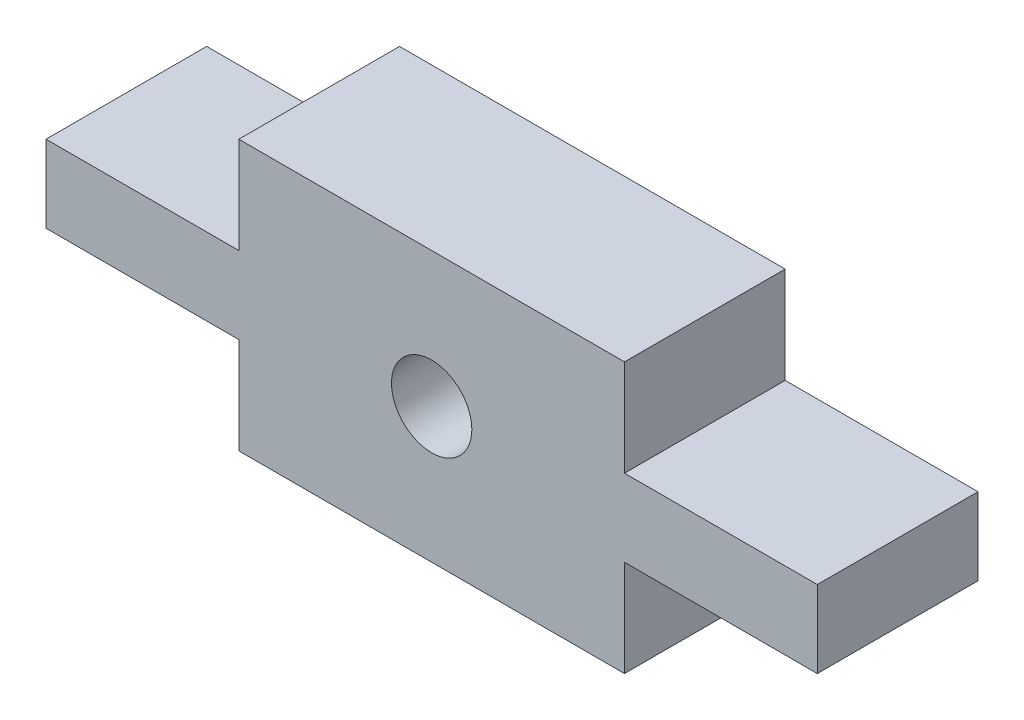
ISO-10303-21;
HEADER;
FILE_DESCRIPTION(('STEP AP214'),'2;1');
FILE_NAME('part.step','',(''),(''),'','','');
FILE_SCHEMA(('AUTOMOTIVE_DESIGN { 1 0 10303 214 1 1 1 1 }'));
ENDSEC;
DATA;
#1=APPLICATION_CONTEXT('core data for automotive mechanical design processes');
#2=APPLICATION_PROTOCOL_DEFINITION('international standard','automotive_design',2000,#1);
#3=PRODUCT_CONTEXT('',#1,'mechanical');
#4=PRODUCT('Part','Part','',(#3));
#5=PRODUCT_RELATED_PRODUCT_CATEGORY('part','',(#4));
#6=PRODUCT_DEFINITION_FORMATION('','',#4);
#7=PRODUCT_DEFINITION_CONTEXT('part definition',#1,'design');
#8=PRODUCT_DEFINITION('design','',#6,#7);
#9=PRODUCT_DEFINITION_SHAPE('','',#8);
#10=(LENGTH_UNIT() NAMED_UNIT(*) SI_UNIT(.MILLI.,.METRE.));
#11=(NAMED_UNIT(*) PLANE_ANGLE_UNIT() SI_UNIT($,.RADIAN.));
#12=(NAMED_UNIT(*) SI_UNIT($,.STERADIAN.) SOLID_ANGLE_UNIT());
#13=UNCERTAINTY_MEASURE_WITH_UNIT(LENGTH_MEASURE(1.E-05),#10,'distance_accuracy_value','');
#14=(GEOMETRIC_REPRESENTATION_CONTEXT(3) GLOBAL_UNCERTAINTY_ASSIGNED_CONTEXT((#13)) GLOBAL_UNIT_ASSIGNED_CONTEXT((#10,
#11,#12)) REPRESENTATION_CONTEXT('',''));
#15=CARTESIAN_POINT('',(0.,0.,0.));
#16=DIRECTION('',(0.,0.,1.));
#17=DIRECTION('',(1.,0.,0.));
#18=AXIS2_PLACEMENT_3D('',#15,#16,#17);
#19=CARTESIAN_POINT('',(0.,0.,5.));
#20=DIRECTION('',(0.,0.,-1.));
#21=DIRECTION('',(-1.,0.,0.));
#22=AXIS2_PLACEMENT_3D('',#19,#20,#21);
#23=PLANE('',#22);
#24=DIRECTION('',(-0.999999999930555,1.17851889356534E-05,0.));
#25=VECTOR('',#24,1.);
#26=CARTESIAN_POINT('',(2365.2396252979,1637.48427422447,5.));
#27=LINE('',#26,#25);
#28=CARTESIAN_POINT('',(2377.23951021652,1637.48413280356,5.));
#29=VERTEX_POINT('',#28);
#30=CARTESIAN_POINT('',(2365.2396252979,1637.48427422447,5.));
#31=VERTEX_POINT('',#30);
#32=EDGE_CURVE('E200',#29,#31,#27,.T.);
#33=ORIENTED_EDGE('',*,*,#32,.T.);
#34=DIRECTION('',(-5.89238710354284E-05,-0.999999998263989,0.));
#35=VECTOR('',#34,1.);
#36=CARTESIAN_POINT('',(2365.23944851965,1634.48416157513,5.));
#37=LINE('',#36,#35);
#38=CARTESIAN_POINT('',(2365.23944851965,1634.48416157513,5.));
#39=VERTEX_POINT('',#38);
#40=EDGE_CURVE('E112',#31,#39,#37,.T.);
#41=ORIENTED_EDGE('',*,*,#40,.T.);
#42=DIRECTION('',(-0.999999999722221,2.35702760606771E-05,0.));
#43=VECTOR('',#42,1.);
#44=CARTESIAN_POINT('',(2359.2394353505,1634.4843029971,5.));
#45=LINE('',#44,#43);
#46=CARTESIAN_POINT('',(2359.2394353505,1634.4843029971,5.));
#47=VERTEX_POINT('',#46);
#48=EDGE_CURVE('E237',#39,#47,#45,.T.);
#49=ORIENTED_EDGE('',*,*,#48,.T.);
#50=DIRECTION('',(-1.17851889330036E-05,-0.999999999930555,0.));
#51=VECTOR('',#50,1.);
#52=CARTESIAN_POINT('',(2359.2394353505,1634.4843029971,5.));
#53=LINE('',#52,#51);
#54=CARTESIAN_POINT('',(2359.23940706532,1632.08424116056,5.));
#55=VERTEX_POINT('',#54);
#56=EDGE_CURVE('E257',#47,#55,#53,.T.);
#57=ORIENTED_EDGE('',*,*,#56,.T.);
#58=DIRECTION('',(1.,-7.53469705410102E-11,0.));
#59=VECTOR('',#58,1.);
#60=CARTESIAN_POINT('',(2365.23942023614,1632.08424116011,5.));
#61=LINE('',#60,#59);
#62=CARTESIAN_POINT('',(2365.23942023614,1632.08424116011,5.));
#63=VERTEX_POINT('',#62);
#64=EDGE_CURVE('E253',#55,#63,#61,.T.);
#65=ORIENTED_EDGE('',*,*,#64,.T.);
#66=DIRECTION('',(1.17847075810225E-05,-0.99999999993056,0.));
#67=VECTOR('',#66,1.);
#68=CARTESIAN_POINT('',(2365.23945559075,1629.08419921878,5.));
#69=LINE('',#68,#67);
#70=CARTESIAN_POINT('',(2365.23945559075,1629.08419921878,5.));
#71=VERTEX_POINT('',#70);
#72=EDGE_CURVE('E256',#63,#71,#69,.T.);
#73=ORIENTED_EDGE('',*,*,#72,.T.);
#74=DIRECTION('',(0.999999999982639,-5.89257828594326E-06,0.));
#75=VECTOR('',#74,1.);
#76=CARTESIAN_POINT('',(2365.23945559075,1629.08419921878,5.));
#77=LINE('',#76,#75);
#78=CARTESIAN_POINT('',(2377.23941122088,1629.08412850811,5.));
#79=VERTEX_POINT('',#78);
#80=EDGE_CURVE('E261',#71,#79,#77,.T.);
#81=ORIENTED_EDGE('',*,*,#80,.T.);
#82=DIRECTION('',(3.53550858177555E-05,0.999999999375009,0.));
#83=VECTOR('',#82,1.);
#84=CARTESIAN_POINT('',(2377.23951728762,1632.0841704472,5.));
#85=LINE('',#84,#83);
#86=CARTESIAN_POINT('',(2377.23951728762,1632.0841704472,5.));
#87=VERTEX_POINT('',#86);
#88=EDGE_CURVE('E268',#79,#87,#85,.T.);
#89=ORIENTED_EDGE('',*,*,#88,.T.);
#90=DIRECTION('',(0.99999999937499,-3.53556374080018E-05,0.));
#91=VECTOR('',#90,1.);
#92=CARTESIAN_POINT('',(2383.23945974526,1632.0839583154,5.));
#93=LINE('',#92,#91);
#94=CARTESIAN_POINT('',(2383.23945974526,1632.0839583154,5.));
#95=VERTEX_POINT('',#94);
#96=EDGE_CURVE('E143',#87,#95,#93,.T.);
#97=ORIENTED_EDGE('',*,*,#96,.T.);
#98=DIRECTION('',(1.17851885629366E-05,0.999999999930555,0.));
#99=VECTOR('',#98,1.);
#100=CARTESIAN_POINT('',(2383.23945974526,1632.0839583154,5.));
#101=LINE('',#100,#99);
#102=CARTESIAN_POINT('',(2383.23948803044,1634.48402015194,5.));
#103=VERTEX_POINT('',#102);
#104=EDGE_CURVE('E137',#95,#103,#101,.T.);
#105=ORIENTED_EDGE('',*,*,#104,.T.);
#106=DIRECTION('',(-1.,1.01622191112792E-10,0.));
#107=VECTOR('',#106,1.);
#108=CARTESIAN_POINT('',(2377.23947485962,1634.48402015255,5.));
#109=LINE('',#108,#107);
#110=CARTESIAN_POINT('',(2377.23947485962,1634.48402015255,5.));
#111=VERTEX_POINT('',#110);
#112=EDGE_CURVE('E141',#103,#111,#109,.T.);
#113=ORIENTED_EDGE('',*,*,#112,.T.);
#114=DIRECTION('',(1.17851887470895E-05,0.999999999930555,0.));
#115=VECTOR('',#114,1.);
#116=CARTESIAN_POINT('',(2377.23951021652,1637.48413280356,5.));
#117=LINE('',#116,#115);
#118=EDGE_CURVE('E57',#111,#29,#117,.T.);
#119=ORIENTED_EDGE('',*,*,#118,.T.);
#120=EDGE_LOOP('',(#33,#41,#49,#57,#65,#73,#81,#89,#97,#105,#113,#119));
#121=FACE_BOUND('',#120,.T.);
#122=CARTESIAN_POINT('',(2371.23951825939,1633.2842013661,5.));
#123=DIRECTION('',(0.,0.,1.));
#124=DIRECTION('',(1.,0.,0.));
#125=AXIS2_PLACEMENT_3D('',#122,#123,#124);
#126=CIRCLE('',#125,1.25000000000008);
#127=CARTESIAN_POINT('',(2372.48951825939,1633.2842013661,5.));
#128=VERTEX_POINT('',#127);
#129=EDGE_CURVE('E170',#128,#128,#126,.T.);
#130=ORIENTED_EDGE('',*,*,#129,.F.);
#131=EDGE_LOOP('',(#130));
#132=FACE_BOUND('',#131,.T.);
#133=ADVANCED_FACE('F39',(#121,#132),#23,.F.);
#134=CARTESIAN_POINT('',(0.,0.,0.));
#135=DIRECTION('',(0.,0.,-1.));
#136=DIRECTION('',(-1.,0.,0.));
#137=AXIS2_PLACEMENT_3D('',#134,#135,#136);
#138=PLANE('',#137);
#139=DIRECTION('',(-0.999999999930555,1.17851889356534E-05,0.));
#140=VECTOR('',#139,1.);
#141=CARTESIAN_POINT('',(2365.2396252979,1637.48427422447,0.));
#142=LINE('',#141,#140);
#143=CARTESIAN_POINT('',(2377.23951021652,1637.48413280356,0.));
#144=VERTEX_POINT('',#143);
#145=CARTESIAN_POINT('',(2365.2396252979,1637.48427422447,0.));
#146=VERTEX_POINT('',#145);
#147=EDGE_CURVE('E165',#144,#146,#142,.T.);
#148=ORIENTED_EDGE('',*,*,#147,.F.);
#149=DIRECTION('',(1.17851887470895E-05,0.999999999930555,0.));
#150=VECTOR('',#149,1.);
#151=CARTESIAN_POINT('',(2377.23951021652,1637.48413280356,0.));
#152=LINE('',#151,#150);
#153=CARTESIAN_POINT('',(2377.23947485962,1634.48402015255,0.));
#154=VERTEX_POINT('',#153);
#155=EDGE_CURVE('E104',#154,#144,#152,.T.);
#156=ORIENTED_EDGE('',*,*,#155,.F.);
#157=DIRECTION('',(-1.,1.01622191112792E-10,0.));
#158=VECTOR('',#157,1.);
#159=CARTESIAN_POINT('',(2377.23947485962,1634.48402015255,0.));
#160=LINE('',#159,#158);
#161=CARTESIAN_POINT('',(2383.23948803044,1634.48402015194,0.));
#162=VERTEX_POINT('',#161);
#163=EDGE_CURVE('E98',#162,#154,#160,.T.);
#164=ORIENTED_EDGE('',*,*,#163,.F.);
#165=DIRECTION('',(1.17851885629366E-05,0.999999999930555,0.));
#166=VECTOR('',#165,1.);
#167=CARTESIAN_POINT('',(2383.23945974526,1632.0839583154,0.));
#168=LINE('',#167,#166);
#169=CARTESIAN_POINT('',(2383.23945974526,1632.0839583154,0.));
#170=VERTEX_POINT('',#169);
#171=EDGE_CURVE('E152',#170,#162,#168,.T.);
#172=ORIENTED_EDGE('',*,*,#171,.F.);
#173=DIRECTION('',(0.99999999937499,-3.53556374080018E-05,0.));
#174=VECTOR('',#173,1.);
#175=CARTESIAN_POINT('',(2383.23945974526,1632.0839583154,0.));
#176=LINE('',#175,#174);
#177=CARTESIAN_POINT('',(2377.23951728762,1632.0841704472,0.));
#178=VERTEX_POINT('',#177);
#179=EDGE_CURVE('E191',#178,#170,#176,.T.);
#180=ORIENTED_EDGE('',*,*,#179,.F.);
#181=DIRECTION('',(3.53550858177555E-05,0.999999999375009,0.));
#182=VECTOR('',#181,1.);
#183=CARTESIAN_POINT('',(2377.23951728762,1632.0841704472,0.));
#184=LINE('',#183,#182);
#185=CARTESIAN_POINT('',(2377.23941122088,1629.08412850811,0.));
#186=VERTEX_POINT('',#185);
#187=EDGE_CURVE('E188',#186,#178,#184,.T.);
#188=ORIENTED_EDGE('',*,*,#187,.F.);
#189=DIRECTION('',(0.999999999982639,-5.89257828594326E-06,0.));
#190=VECTOR('',#189,1.);
#191=CARTESIAN_POINT('',(2365.23945559075,1629.08419921878,0.));
#192=LINE('',#191,#190);
#193=CARTESIAN_POINT('',(2365.23945559075,1629.08419921878,0.));
#194=VERTEX_POINT('',#193);
#195=EDGE_CURVE('E185',#194,#186,#192,.T.);
#196=ORIENTED_EDGE('',*,*,#195,.F.);
#197=DIRECTION('',(1.17847075810225E-05,-0.99999999993056,0.));
#198=VECTOR('',#197,1.);
#199=CARTESIAN_POINT('',(2365.23945559075,1629.08419921878,0.));
#200=LINE('',#199,#198);
#201=CARTESIAN_POINT('',(2365.23942023614,1632.08424116011,0.));
#202=VERTEX_POINT('',#201);
#203=EDGE_CURVE('E182',#202,#194,#200,.T.);
#204=ORIENTED_EDGE('',*,*,#203,.F.);
#205=DIRECTION('',(1.,-7.53469705410102E-11,0.));
#206=VECTOR('',#205,1.);
#207=CARTESIAN_POINT('',(2365.23942023614,1632.08424116011,0.));
#208=LINE('',#207,#206);
#209=CARTESIAN_POINT('',(2359.23940706532,1632.08424116056,0.));
#210=VERTEX_POINT('',#209);
#211=EDGE_CURVE('E179',#210,#202,#208,.T.);
#212=ORIENTED_EDGE('',*,*,#211,.F.);
#213=DIRECTION('',(-1.17851889330036E-05,-0.999999999930555,0.));
#214=VECTOR('',#213,1.);
#215=CARTESIAN_POINT('',(2359.2394353505,1634.4843029971,0.));
#216=LINE('',#215,#214);
#217=CARTESIAN_POINT('',(2359.2394353505,1634.4843029971,0.));
#218=VERTEX_POINT('',#217);
#219=EDGE_CURVE('E176',#218,#210,#216,.T.);
#220=ORIENTED_EDGE('',*,*,#219,.F.);
#221=DIRECTION('',(-0.999999999722221,2.35702760606771E-05,0.));
#222=VECTOR('',#221,1.);
#223=CARTESIAN_POINT('',(2359.2394353505,1634.4843029971,0.));
#224=LINE('',#223,#222);
#225=CARTESIAN_POINT('',(2365.23944851965,1634.48416157513,0.));
#226=VERTEX_POINT('',#225);
#227=EDGE_CURVE('E173',#226,#218,#224,.T.);
#228=ORIENTED_EDGE('',*,*,#227,.F.);
#229=DIRECTION('',(-5.89238710354284E-05,-0.999999998263989,0.));
#230=VECTOR('',#229,1.);
#231=CARTESIAN_POINT('',(2365.23944851965,1634.48416157513,0.));
#232=LINE('',#231,#230);
#233=EDGE_CURVE('E169',#146,#226,#232,.T.);
#234=ORIENTED_EDGE('',*,*,#233,.F.);
#235=EDGE_LOOP('',(#148,#156,#164,#172,#180,#188,#196,#204,#212,#220,#228,#234));
#236=FACE_BOUND('',#235,.T.);
#237=CARTESIAN_POINT('',(2371.23951825939,1633.2842013661,0.));
#238=DIRECTION('',(0.,0.,1.));
#239=DIRECTION('',(1.,0.,0.));
#240=AXIS2_PLACEMENT_3D('',#237,#238,#239);
#241=CIRCLE('',#240,1.25000000000008);
#242=CARTESIAN_POINT('',(2372.48951825939,1633.2842013661,0.));
#243=VERTEX_POINT('',#242);
#244=EDGE_CURVE('E417',#243,#243,#241,.T.);
#245=ORIENTED_EDGE('',*,*,#244,.T.);
#246=EDGE_LOOP('',(#245));
#247=FACE_BOUND('',#246,.T.);
#248=ADVANCED_FACE('F241',(#236,#247),#138,.T.);
#249=CARTESIAN_POINT('',(2365.2396252979,1637.48427422447,5.));
#250=DIRECTION('',(-1.17851889356534E-05,-0.999999999930555,0.));
#251=DIRECTION('',(0.999999999930555,-1.17851889356534E-05,0.));
#252=AXIS2_PLACEMENT_3D('',#249,#250,#251);
#253=PLANE('',#252);
#254=ORIENTED_EDGE('',*,*,#147,.T.);
#255=DIRECTION('',(0.,0.,-1.));
#256=VECTOR('',#255,1.);
#257=CARTESIAN_POINT('',(2365.2396252979,1637.48427422447,5.));
#258=LINE('',#257,#256);
#259=EDGE_CURVE('E11',#31,#146,#258,.T.);
#260=ORIENTED_EDGE('',*,*,#259,.F.);
#261=ORIENTED_EDGE('',*,*,#32,.F.);
#262=DIRECTION('',(0.,0.,-1.));
#263=VECTOR('',#262,1.);
#264=CARTESIAN_POINT('',(2377.23951021652,1637.48413280356,5.));
#265=LINE('',#264,#263);
#266=EDGE_CURVE('E161',#29,#144,#265,.T.);
#267=ORIENTED_EDGE('',*,*,#266,.T.);
#268=EDGE_LOOP('',(#254,#260,#261,#267));
#269=FACE_BOUND('',#268,.T.);
#270=ADVANCED_FACE('F41',(#269),#253,.F.);
#271=CARTESIAN_POINT('',(2365.23944851965,1634.48416157513,5.));
#272=DIRECTION('',(0.999999998263989,-5.89238710354284E-05,0.));
#273=DIRECTION('',(5.89238710354284E-05,0.999999998263989,0.));
#274=AXIS2_PLACEMENT_3D('',#271,#272,#273);
#275=PLANE('',#274);
#276=ORIENTED_EDGE('',*,*,#233,.T.);
#277=DIRECTION('',(0.,0.,-1.));
#278=VECTOR('',#277,1.);
#279=CARTESIAN_POINT('',(2365.23944851965,1634.48416157513,5.));
#280=LINE('',#279,#278);
#281=EDGE_CURVE('E49',#39,#226,#280,.T.);
#282=ORIENTED_EDGE('',*,*,#281,.F.);
#283=ORIENTED_EDGE('',*,*,#40,.F.);
#284=ORIENTED_EDGE('',*,*,#259,.T.);
#285=EDGE_LOOP('',(#276,#282,#283,#284));
#286=FACE_BOUND('',#285,.T.);
#287=ADVANCED_FACE('F304',(#286),#275,.F.);
#288=CARTESIAN_POINT('',(2359.2394353505,1634.4843029971,5.));
#289=DIRECTION('',(-2.35702760606771E-05,-0.999999999722221,0.));
#290=DIRECTION('',(0.999999999722221,-2.35702760606771E-05,0.));
#291=AXIS2_PLACEMENT_3D('',#288,#289,#290);
#292=PLANE('',#291);
#293=ORIENTED_EDGE('',*,*,#227,.T.);
#294=DIRECTION('',(0.,0.,-1.));
#295=VECTOR('',#294,1.);
#296=CARTESIAN_POINT('',(2359.2394353505,1634.4843029971,5.));
#297=LINE('',#296,#295);
#298=EDGE_CURVE('E227',#47,#218,#297,.T.);
#299=ORIENTED_EDGE('',*,*,#298,.F.);
#300=ORIENTED_EDGE('',*,*,#48,.F.);
#301=ORIENTED_EDGE('',*,*,#281,.T.);
#302=EDGE_LOOP('',(#293,#299,#300,#301));
#303=FACE_BOUND('',#302,.T.);
#304=ADVANCED_FACE('F235',(#303),#292,.F.);
#305=CARTESIAN_POINT('',(2359.2394353505,1634.4843029971,5.));
#306=DIRECTION('',(0.999999999930555,-1.17851889330036E-05,0.));
#307=DIRECTION('',(1.17851889330036E-05,0.999999999930555,0.));
#308=AXIS2_PLACEMENT_3D('',#305,#306,#307);
#309=PLANE('',#308);
#310=ORIENTED_EDGE('',*,*,#219,.T.);
#311=DIRECTION('',(0.,0.,-1.));
#312=VECTOR('',#311,1.);
#313=CARTESIAN_POINT('',(2359.23940706532,1632.08424116056,5.));
#314=LINE('',#313,#312);
#315=EDGE_CURVE('E223',#55,#210,#314,.T.);
#316=ORIENTED_EDGE('',*,*,#315,.F.);
#317=ORIENTED_EDGE('',*,*,#56,.F.);
#318=ORIENTED_EDGE('',*,*,#298,.T.);
#319=EDGE_LOOP('',(#310,#316,#317,#318));
#320=FACE_BOUND('',#319,.T.);
#321=ADVANCED_FACE('F247',(#320),#309,.F.);
#322=CARTESIAN_POINT('',(2365.23942023614,1632.08424116011,5.));
#323=DIRECTION('',(7.53469705410102E-11,1.,0.));
#324=DIRECTION('',(-1.,7.53469705410102E-11,0.));
#325=AXIS2_PLACEMENT_3D('',#322,#323,#324);
#326=PLANE('',#325);
#327=ORIENTED_EDGE('',*,*,#211,.T.);
#328=DIRECTION('',(0.,0.,-1.));
#329=VECTOR('',#328,1.);
#330=CARTESIAN_POINT('',(2365.23942023614,1632.08424116011,5.));
#331=LINE('',#330,#329);
#332=EDGE_CURVE('E219',#63,#202,#331,.T.);
#333=ORIENTED_EDGE('',*,*,#332,.F.);
#334=ORIENTED_EDGE('',*,*,#64,.F.);
#335=ORIENTED_EDGE('',*,*,#315,.T.);
#336=EDGE_LOOP('',(#327,#333,#334,#335));
#337=FACE_BOUND('',#336,.T.);
#338=ADVANCED_FACE('F251',(#337),#326,.F.);
#339=CARTESIAN_POINT('',(2365.23945559075,1629.08419921878,5.));
#340=DIRECTION('',(0.99999999993056,1.17847075810225E-05,0.));
#341=DIRECTION('',(-1.17847075810225E-05,0.99999999993056,0.));
#342=AXIS2_PLACEMENT_3D('',#339,#340,#341);
#343=PLANE('',#342);
#344=ORIENTED_EDGE('',*,*,#203,.T.);
#345=DIRECTION('',(0.,0.,-1.));
#346=VECTOR('',#345,1.);
#347=CARTESIAN_POINT('',(2365.23945559075,1629.08419921878,5.));
#348=LINE('',#347,#346);
#349=EDGE_CURVE('E215',#71,#194,#348,.T.);
#350=ORIENTED_EDGE('',*,*,#349,.F.);
#351=ORIENTED_EDGE('',*,*,#72,.F.);
#352=ORIENTED_EDGE('',*,*,#332,.T.);
#353=EDGE_LOOP('',(#344,#350,#351,#352));
#354=FACE_BOUND('',#353,.T.);
#355=ADVANCED_FACE('F317',(#354),#343,.F.);
#356=CARTESIAN_POINT('',(2365.23945559075,1629.08419921878,5.));
#357=DIRECTION('',(5.89257828594326E-06,0.999999999982639,0.));
#358=DIRECTION('',(-0.999999999982639,5.89257828594326E-06,0.));
#359=AXIS2_PLACEMENT_3D('',#356,#357,#358);
#360=PLANE('',#359);
#361=ORIENTED_EDGE('',*,*,#195,.T.);
#362=DIRECTION('',(0.,0.,-1.));
#363=VECTOR('',#362,1.);
#364=CARTESIAN_POINT('',(2377.23941122088,1629.08412850811,5.));
#365=LINE('',#364,#363);
#366=EDGE_CURVE('E211',#79,#186,#365,.T.);
#367=ORIENTED_EDGE('',*,*,#366,.F.);
#368=ORIENTED_EDGE('',*,*,#80,.F.);
#369=ORIENTED_EDGE('',*,*,#349,.T.);
#370=EDGE_LOOP('',(#361,#367,#368,#369));
#371=FACE_BOUND('',#370,.T.);
#372=ADVANCED_FACE('F320',(#371),#360,.F.);
#373=CARTESIAN_POINT('',(2377.23951728762,1632.0841704472,5.));
#374=DIRECTION('',(-0.999999999375009,3.53550858177555E-05,0.));
#375=DIRECTION('',(-3.53550858177555E-05,-0.999999999375009,0.));
#376=AXIS2_PLACEMENT_3D('',#373,#374,#375);
#377=PLANE('',#376);
#378=ORIENTED_EDGE('',*,*,#187,.T.);
#379=DIRECTION('',(0.,0.,-1.));
#380=VECTOR('',#379,1.);
#381=CARTESIAN_POINT('',(2377.23951728762,1632.0841704472,5.));
#382=LINE('',#381,#380);
#383=EDGE_CURVE('E207',#87,#178,#382,.T.);
#384=ORIENTED_EDGE('',*,*,#383,.F.);
#385=ORIENTED_EDGE('',*,*,#88,.F.);
#386=ORIENTED_EDGE('',*,*,#366,.T.);
#387=EDGE_LOOP('',(#378,#384,#385,#386));
#388=FACE_BOUND('',#387,.T.);
#389=ADVANCED_FACE('F276',(#388),#377,.F.);
#390=CARTESIAN_POINT('',(2383.23945974526,1632.0839583154,5.));
#391=DIRECTION('',(3.53556374080018E-05,0.999999999374989,0.));
#392=DIRECTION('',(-0.99999999937499,3.53556374080018E-05,0.));
#393=AXIS2_PLACEMENT_3D('',#390,#391,#392);
#394=PLANE('',#393);
#395=ORIENTED_EDGE('',*,*,#179,.T.);
#396=DIRECTION('',(0.,0.,-1.));
#397=VECTOR('',#396,1.);
#398=CARTESIAN_POINT('',(2383.23945974526,1632.0839583154,5.));
#399=LINE('',#398,#397);
#400=EDGE_CURVE('E154',#95,#170,#399,.T.);
#401=ORIENTED_EDGE('',*,*,#400,.F.);
#402=ORIENTED_EDGE('',*,*,#96,.F.);
#403=ORIENTED_EDGE('',*,*,#383,.T.);
#404=EDGE_LOOP('',(#395,#401,#402,#403));
#405=FACE_BOUND('',#404,.T.);
#406=ADVANCED_FACE('F280',(#405),#394,.F.);
#407=CARTESIAN_POINT('',(2383.23945974526,1632.0839583154,5.));
#408=DIRECTION('',(-0.999999999930555,1.17851885629366E-05,0.));
#409=DIRECTION('',(-1.17851885629366E-05,-0.999999999930555,0.));
#410=AXIS2_PLACEMENT_3D('',#407,#408,#409);
#411=PLANE('',#410);
#412=ORIENTED_EDGE('',*,*,#171,.T.);
#413=DIRECTION('',(0.,0.,-1.));
#414=VECTOR('',#413,1.);
#415=CARTESIAN_POINT('',(2383.23948803044,1634.48402015194,5.));
#416=LINE('',#415,#414);
#417=EDGE_CURVE('E149',#103,#162,#416,.T.);
#418=ORIENTED_EDGE('',*,*,#417,.F.);
#419=ORIENTED_EDGE('',*,*,#104,.F.);
#420=ORIENTED_EDGE('',*,*,#400,.T.);
#421=EDGE_LOOP('',(#412,#418,#419,#420));
#422=FACE_BOUND('',#421,.T.);
#423=ADVANCED_FACE('F150',(#422),#411,.F.);
#424=CARTESIAN_POINT('',(2377.23947485962,1634.48402015255,5.));
#425=DIRECTION('',(-1.01622191112792E-10,-1.,0.));
#426=DIRECTION('',(1.,-1.01622191112792E-10,0.));
#427=AXIS2_PLACEMENT_3D('',#424,#425,#426);
#428=PLANE('',#427);
#429=ORIENTED_EDGE('',*,*,#163,.T.);
#430=DIRECTION('',(0.,0.,-1.));
#431=VECTOR('',#430,1.);
#432=CARTESIAN_POINT('',(2377.23947485962,1634.48402015255,5.));
#433=LINE('',#432,#431);
#434=EDGE_CURVE('E155',#111,#154,#433,.T.);
#435=ORIENTED_EDGE('',*,*,#434,.F.);
#436=ORIENTED_EDGE('',*,*,#112,.F.);
#437=ORIENTED_EDGE('',*,*,#417,.T.);
#438=EDGE_LOOP('',(#429,#435,#436,#437));
#439=FACE_BOUND('',#438,.T.);
#440=ADVANCED_FACE('F157',(#439),#428,.F.);
#441=CARTESIAN_POINT('',(2377.23951021652,1637.48413280356,5.));
#442=DIRECTION('',(-0.999999999930555,1.17851887470895E-05,0.));
#443=DIRECTION('',(-1.17851887470895E-05,-0.999999999930555,0.));
#444=AXIS2_PLACEMENT_3D('',#441,#442,#443);
#445=PLANE('',#444);
#446=ORIENTED_EDGE('',*,*,#155,.T.);
#447=ORIENTED_EDGE('',*,*,#266,.F.);
#448=ORIENTED_EDGE('',*,*,#118,.F.);
#449=ORIENTED_EDGE('',*,*,#434,.T.);
#450=EDGE_LOOP('',(#446,#447,#448,#449));
#451=FACE_BOUND('',#450,.T.);
#452=ADVANCED_FACE('F284',(#451),#445,.F.);
#453=CARTESIAN_POINT('',(2371.23951825939,1633.2842013661,5.));
#454=DIRECTION('',(0.,0.,-1.));
#455=DIRECTION('',(-1.,0.,0.));
#456=AXIS2_PLACEMENT_3D('',#453,#454,#455);
#457=CYLINDRICAL_SURFACE('',#456,1.25000000000008);
#458=ORIENTED_EDGE('',*,*,#129,.T.);
#459=EDGE_LOOP('',(#458));
#460=FACE_BOUND('',#459,.T.);
#461=ORIENTED_EDGE('',*,*,#244,.F.);
#462=EDGE_LOOP('',(#461));
#463=FACE_BOUND('',#462,.T.);
#464=ADVANCED_FACE('F286',(#460,#463),#457,.F.);
#465=CLOSED_SHELL('',(#133,#248,#270,#287,#304,#321,#338,#355,#372,#389,#406,#423,#440,#452,#464));
#466=MANIFOLD_SOLID_BREP('B2',#465);
#467=ADVANCED_BREP_SHAPE_REPRESENTATION('',(#18,#466),#14);
#468=SHAPE_DEFINITION_REPRESENTATION(#9,#467);
ENDSEC;
END-ISO-10303-21;
